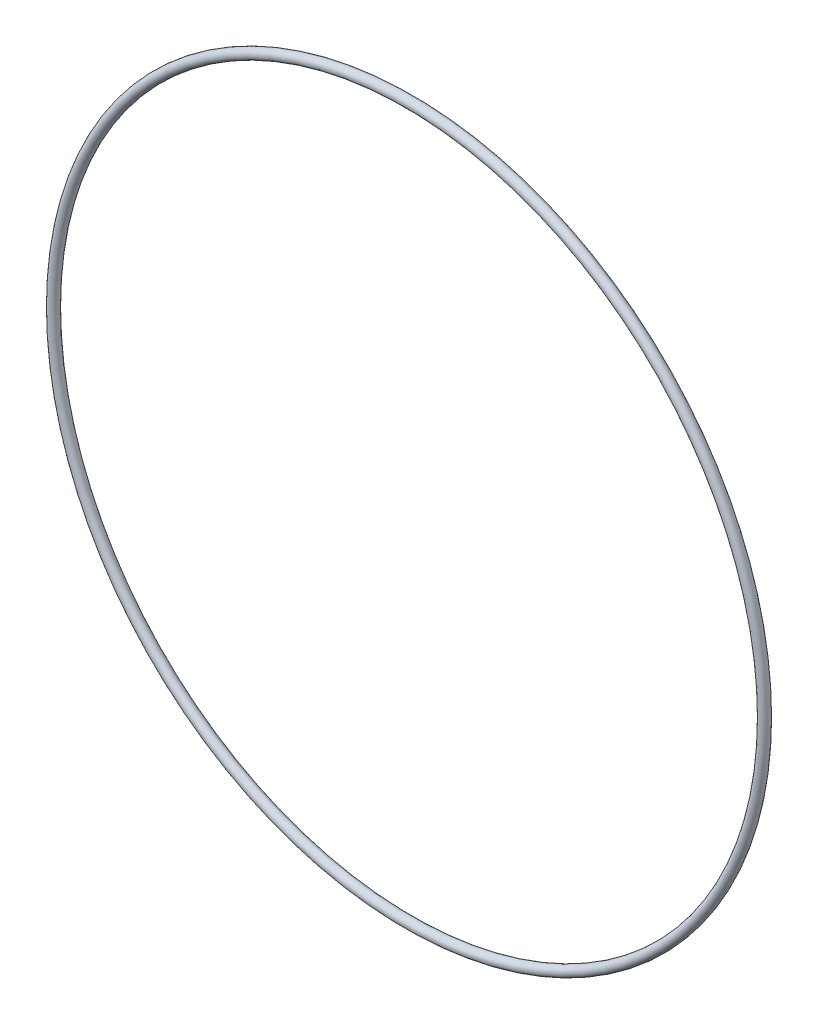
ISO-10303-21;
HEADER;
FILE_DESCRIPTION(('STEP AP214'),'2;1');
FILE_NAME('part.step','',(''),(''),'','','');
FILE_SCHEMA(('AUTOMOTIVE_DESIGN { 1 0 10303 214 1 1 1 1 }'));
ENDSEC;
DATA;
#1=APPLICATION_CONTEXT('core data for automotive mechanical design processes');
#2=APPLICATION_PROTOCOL_DEFINITION('international standard','automotive_design',2000,#1);
#3=PRODUCT_CONTEXT('',#1,'mechanical');
#4=PRODUCT('Part','Part','',(#3));
#5=PRODUCT_RELATED_PRODUCT_CATEGORY('part','',(#4));
#6=PRODUCT_DEFINITION_FORMATION('','',#4);
#7=PRODUCT_DEFINITION_CONTEXT('part definition',#1,'design');
#8=PRODUCT_DEFINITION('design','',#6,#7);
#9=PRODUCT_DEFINITION_SHAPE('','',#8);
#10=(LENGTH_UNIT() NAMED_UNIT(*) SI_UNIT(.MILLI.,.METRE.));
#11=(NAMED_UNIT(*) PLANE_ANGLE_UNIT() SI_UNIT($,.RADIAN.));
#12=(NAMED_UNIT(*) SI_UNIT($,.STERADIAN.) SOLID_ANGLE_UNIT());
#13=UNCERTAINTY_MEASURE_WITH_UNIT(LENGTH_MEASURE(1.E-05),#10,'distance_accuracy_value','');
#14=(GEOMETRIC_REPRESENTATION_CONTEXT(3) GLOBAL_UNCERTAINTY_ASSIGNED_CONTEXT((#13)) GLOBAL_UNIT_ASSIGNED_CONTEXT((#10,
#11,#12)) REPRESENTATION_CONTEXT('',''));
#15=CARTESIAN_POINT('',(0.,0.,0.));
#16=DIRECTION('',(0.,0.,1.));
#17=DIRECTION('',(1.,0.,0.));
#18=AXIS2_PLACEMENT_3D('',#15,#16,#17);
#19=CARTESIAN_POINT('',(0.,0.,0.));
#20=DIRECTION('',(0.,0.,1.));
#21=DIRECTION('',(1.,0.,0.));
#22=AXIS2_PLACEMENT_3D('',#19,#20,#21);
#23=TOROIDAL_SURFACE('',#22,125.3871,1.7653);
#24=CARTESIAN_POINT('',(127.1524,0.,0.));
#25=VERTEX_POINT('',#24);
#26=VERTEX_LOOP('',#25);
#27=FACE_BOUND('',#26,.T.);
#28=ADVANCED_FACE('F28',(#27),#23,.T.);
#29=CLOSED_SHELL('',(#28));
#30=MANIFOLD_SOLID_BREP('B2',#29);
#31=ADVANCED_BREP_SHAPE_REPRESENTATION('',(#18,#30),#14);
#32=SHAPE_DEFINITION_REPRESENTATION(#9,#31);
ENDSEC;
END-ISO-10303-21;
